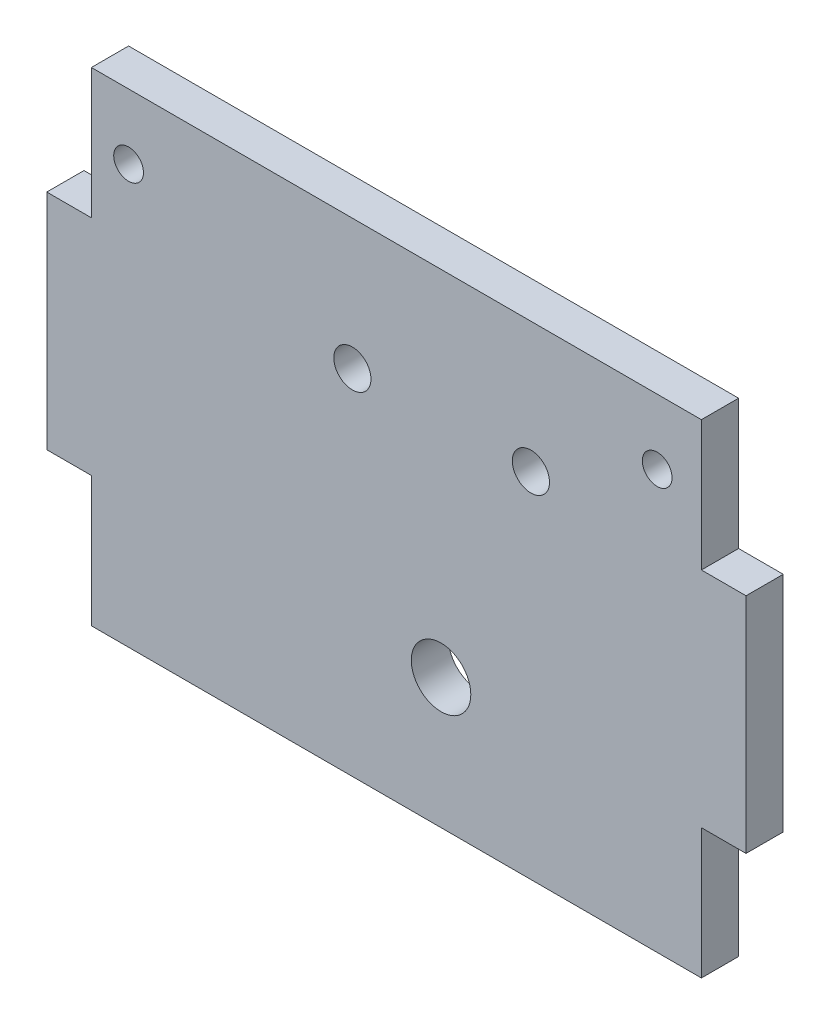
ISO-10303-21;
HEADER;
FILE_DESCRIPTION(('STEP AP214'),'2;1');
FILE_NAME('part.step','',(''),(''),'','','');
FILE_SCHEMA(('AUTOMOTIVE_DESIGN { 1 0 10303 214 1 1 1 1 }'));
ENDSEC;
DATA;
#1=APPLICATION_CONTEXT('core data for automotive mechanical design processes');
#2=APPLICATION_PROTOCOL_DEFINITION('international standard','automotive_design',2000,#1);
#3=PRODUCT_CONTEXT('',#1,'mechanical');
#4=PRODUCT('Part','Part','',(#3));
#5=PRODUCT_RELATED_PRODUCT_CATEGORY('part','',(#4));
#6=PRODUCT_DEFINITION_FORMATION('','',#4);
#7=PRODUCT_DEFINITION_CONTEXT('part definition',#1,'design');
#8=PRODUCT_DEFINITION('design','',#6,#7);
#9=PRODUCT_DEFINITION_SHAPE('','',#8);
#10=(LENGTH_UNIT() NAMED_UNIT(*) SI_UNIT(.MILLI.,.METRE.));
#11=(NAMED_UNIT(*) PLANE_ANGLE_UNIT() SI_UNIT($,.RADIAN.));
#12=(NAMED_UNIT(*) SI_UNIT($,.STERADIAN.) SOLID_ANGLE_UNIT());
#13=UNCERTAINTY_MEASURE_WITH_UNIT(LENGTH_MEASURE(1.E-05),#10,'distance_accuracy_value','');
#14=(GEOMETRIC_REPRESENTATION_CONTEXT(3) GLOBAL_UNCERTAINTY_ASSIGNED_CONTEXT((#13)) GLOBAL_UNIT_ASSIGNED_CONTEXT((#10,
#11,#12)) REPRESENTATION_CONTEXT('',''));
#15=CARTESIAN_POINT('',(0.,0.,0.));
#16=DIRECTION('',(0.,0.,1.));
#17=DIRECTION('',(1.,0.,0.));
#18=AXIS2_PLACEMENT_3D('',#15,#16,#17);
#19=CARTESIAN_POINT('',(0.,17.5,-30.5941170815567));
#20=DIRECTION('',(0.,-1.,0.));
#21=DIRECTION('',(0.,0.,-1.));
#22=AXIS2_PLACEMENT_3D('',#19,#20,#21);
#23=PLANE('',#22);
#24=DIRECTION('',(1.,0.,0.));
#25=VECTOR('',#24,1.);
#26=CARTESIAN_POINT('',(0.,17.5,5.));
#27=LINE('',#26,#25);
#28=CARTESIAN_POINT('',(60.,17.5,5.));
#29=VERTEX_POINT('',#28);
#30=CARTESIAN_POINT('',(66.,17.5,5.));
#31=VERTEX_POINT('',#30);
#32=EDGE_CURVE('E185',#29,#31,#27,.T.);
#33=ORIENTED_EDGE('',*,*,#32,.F.);
#34=DIRECTION('',(0.,0.,1.));
#35=VECTOR('',#34,1.);
#36=CARTESIAN_POINT('',(60.,17.5,5.));
#37=LINE('',#36,#35);
#38=CARTESIAN_POINT('',(60.,17.5,0.));
#39=VERTEX_POINT('',#38);
#40=EDGE_CURVE('E142',#39,#29,#37,.T.);
#41=ORIENTED_EDGE('',*,*,#40,.F.);
#42=DIRECTION('',(1.,0.,0.));
#43=VECTOR('',#42,1.);
#44=CARTESIAN_POINT('',(0.,17.5,0.));
#45=LINE('',#44,#43);
#46=CARTESIAN_POINT('',(66.,17.5,0.));
#47=VERTEX_POINT('',#46);
#48=EDGE_CURVE('E187',#39,#47,#45,.T.);
#49=ORIENTED_EDGE('',*,*,#48,.T.);
#50=DIRECTION('',(0.,0.,-1.));
#51=VECTOR('',#50,1.);
#52=CARTESIAN_POINT('',(66.,17.5,0.));
#53=LINE('',#52,#51);
#54=EDGE_CURVE('E161',#31,#47,#53,.T.);
#55=ORIENTED_EDGE('',*,*,#54,.F.);
#56=EDGE_LOOP('',(#33,#41,#49,#55));
#57=FACE_BOUND('',#56,.T.);
#58=ADVANCED_FACE('F33',(#57),#23,.T.);
#59=CARTESIAN_POINT('',(-22.,65.,70.0076918525801));
#60=DIRECTION('',(-1.,0.,0.));
#61=DIRECTION('',(0.,0.,1.));
#62=AXIS2_PLACEMENT_3D('',#59,#60,#61);
#63=PLANE('',#62);
#64=DIRECTION('',(0.,1.,0.));
#65=VECTOR('',#64,1.);
#66=CARTESIAN_POINT('',(-22.,65.,0.));
#67=LINE('',#66,#65);
#68=CARTESIAN_POINT('',(-22.,47.5,0.));
#69=VERTEX_POINT('',#68);
#70=CARTESIAN_POINT('',(-22.,65.,0.));
#71=VERTEX_POINT('',#70);
#72=EDGE_CURVE('E58',#69,#71,#67,.T.);
#73=ORIENTED_EDGE('',*,*,#72,.F.);
#74=DIRECTION('',(0.,0.,1.));
#75=VECTOR('',#74,1.);
#76=CARTESIAN_POINT('',(-22.,47.5,-30.5941170815567));
#77=LINE('',#76,#75);
#78=CARTESIAN_POINT('',(-22.,47.5,5.));
#79=VERTEX_POINT('',#78);
#80=EDGE_CURVE('E202',#69,#79,#77,.T.);
#81=ORIENTED_EDGE('',*,*,#80,.T.);
#82=DIRECTION('',(0.,-1.,0.));
#83=VECTOR('',#82,1.);
#84=CARTESIAN_POINT('',(-22.,65.,5.));
#85=LINE('',#84,#83);
#86=CARTESIAN_POINT('',(-22.,65.,5.));
#87=VERTEX_POINT('',#86);
#88=EDGE_CURVE('E216',#87,#79,#85,.T.);
#89=ORIENTED_EDGE('',*,*,#88,.F.);
#90=DIRECTION('',(0.,0.,-1.));
#91=VECTOR('',#90,1.);
#92=CARTESIAN_POINT('',(-22.,65.,70.0076918525801));
#93=LINE('',#92,#91);
#94=EDGE_CURVE('E224',#87,#71,#93,.T.);
#95=ORIENTED_EDGE('',*,*,#94,.T.);
#96=EDGE_LOOP('',(#73,#81,#89,#95));
#97=FACE_BOUND('',#96,.T.);
#98=ADVANCED_FACE('F255',(#97),#63,.T.);
#99=CARTESIAN_POINT('',(0.,0.,5.));
#100=DIRECTION('',(0.,0.,-1.));
#101=DIRECTION('',(-1.,0.,0.));
#102=AXIS2_PLACEMENT_3D('',#99,#100,#101);
#103=PLANE('',#102);
#104=CARTESIAN_POINT('',(13.0817527217629,47.5,5.));
#105=DIRECTION('',(0.,0.,1.));
#106=DIRECTION('',(1.,0.,0.));
#107=AXIS2_PLACEMENT_3D('',#104,#105,#106);
#108=CIRCLE('',#107,2.5);
#109=CARTESIAN_POINT('',(15.5817527217629,47.5,5.));
#110=VERTEX_POINT('',#109);
#111=EDGE_CURVE('E238',#110,#110,#108,.T.);
#112=ORIENTED_EDGE('',*,*,#111,.F.);
#113=EDGE_LOOP('',(#112));
#114=FACE_BOUND('',#113,.T.);
#115=CARTESIAN_POINT('',(37.0817527217629,47.5,5.));
#116=DIRECTION('',(0.,0.,1.));
#117=DIRECTION('',(1.,0.,0.));
#118=AXIS2_PLACEMENT_3D('',#115,#116,#117);
#119=CIRCLE('',#118,2.5);
#120=CARTESIAN_POINT('',(39.5817527217629,47.5,5.));
#121=VERTEX_POINT('',#120);
#122=EDGE_CURVE('E243',#121,#121,#119,.T.);
#123=ORIENTED_EDGE('',*,*,#122,.F.);
#124=EDGE_LOOP('',(#123));
#125=FACE_BOUND('',#124,.T.);
#126=CARTESIAN_POINT('',(54.0556394164773,56.25,5.));
#127=DIRECTION('',(0.,0.,1.));
#128=DIRECTION('',(1.,0.,0.));
#129=AXIS2_PLACEMENT_3D('',#126,#127,#128);
#130=CIRCLE('',#129,2.);
#131=CARTESIAN_POINT('',(56.0556394164773,56.25,5.));
#132=VERTEX_POINT('',#131);
#133=EDGE_CURVE('E146',#132,#132,#130,.T.);
#134=ORIENTED_EDGE('',*,*,#133,.F.);
#135=EDGE_LOOP('',(#134));
#136=FACE_BOUND('',#135,.T.);
#137=DIRECTION('',(0.,-1.,0.));
#138=VECTOR('',#137,1.);
#139=CARTESIAN_POINT('',(60.,65.,5.));
#140=LINE('',#139,#138);
#141=CARTESIAN_POINT('',(60.,65.,5.));
#142=VERTEX_POINT('',#141);
#143=CARTESIAN_POINT('',(60.,47.5,5.));
#144=VERTEX_POINT('',#143);
#145=EDGE_CURVE('E169',#142,#144,#140,.T.);
#146=ORIENTED_EDGE('',*,*,#145,.F.);
#147=DIRECTION('',(-1.,0.,0.));
#148=VECTOR('',#147,1.);
#149=CARTESIAN_POINT('',(0.,65.,5.));
#150=LINE('',#149,#148);
#151=EDGE_CURVE('E11',#142,#87,#150,.T.);
#152=ORIENTED_EDGE('',*,*,#151,.T.);
#153=ORIENTED_EDGE('',*,*,#88,.T.);
#154=DIRECTION('',(1.,0.,0.));
#155=VECTOR('',#154,1.);
#156=CARTESIAN_POINT('',(0.,47.5,5.));
#157=LINE('',#156,#155);
#158=CARTESIAN_POINT('',(-28.,47.5,5.));
#159=VERTEX_POINT('',#158);
#160=EDGE_CURVE('E199',#159,#79,#157,.T.);
#161=ORIENTED_EDGE('',*,*,#160,.F.);
#162=DIRECTION('',(0.,1.,0.));
#163=VECTOR('',#162,1.);
#164=CARTESIAN_POINT('',(-28.,0.,5.));
#165=LINE('',#164,#163);
#166=CARTESIAN_POINT('',(-28.,17.5,5.));
#167=VERTEX_POINT('',#166);
#168=EDGE_CURVE('E195',#167,#159,#165,.T.);
#169=ORIENTED_EDGE('',*,*,#168,.F.);
#170=DIRECTION('',(-1.,0.,0.));
#171=VECTOR('',#170,1.);
#172=CARTESIAN_POINT('',(0.,17.5,5.));
#173=LINE('',#172,#171);
#174=CARTESIAN_POINT('',(-22.,17.5,5.));
#175=VERTEX_POINT('',#174);
#176=EDGE_CURVE('E190',#175,#167,#173,.T.);
#177=ORIENTED_EDGE('',*,*,#176,.F.);
#178=CARTESIAN_POINT('',(-22.,0.,5.));
#179=VERTEX_POINT('',#178);
#180=EDGE_CURVE('E132',#175,#179,#85,.T.);
#181=ORIENTED_EDGE('',*,*,#180,.T.);
#182=DIRECTION('',(1.,0.,0.));
#183=VECTOR('',#182,1.);
#184=CARTESIAN_POINT('',(0.,0.,5.));
#185=LINE('',#184,#183);
#186=CARTESIAN_POINT('',(60.,0.,5.));
#187=VERTEX_POINT('',#186);
#188=EDGE_CURVE('E42',#179,#187,#185,.T.);
#189=ORIENTED_EDGE('',*,*,#188,.T.);
#190=DIRECTION('',(0.,-1.,0.));
#191=VECTOR('',#190,1.);
#192=CARTESIAN_POINT('',(60.,0.,5.));
#193=LINE('',#192,#191);
#194=EDGE_CURVE('E129',#29,#187,#193,.T.);
#195=ORIENTED_EDGE('',*,*,#194,.F.);
#196=ORIENTED_EDGE('',*,*,#32,.T.);
#197=DIRECTION('',(0.,-1.,0.));
#198=VECTOR('',#197,1.);
#199=CARTESIAN_POINT('',(66.,47.5,5.));
#200=LINE('',#199,#198);
#201=CARTESIAN_POINT('',(66.,47.5,5.));
#202=VERTEX_POINT('',#201);
#203=EDGE_CURVE('E158',#202,#31,#200,.T.);
#204=ORIENTED_EDGE('',*,*,#203,.F.);
#205=DIRECTION('',(-1.,0.,0.));
#206=VECTOR('',#205,1.);
#207=CARTESIAN_POINT('',(66.,47.5,5.));
#208=LINE('',#207,#206);
#209=EDGE_CURVE('E164',#202,#144,#208,.T.);
#210=ORIENTED_EDGE('',*,*,#209,.T.);
#211=EDGE_LOOP('',(#146,#152,#153,#161,#169,#177,#181,#189,#195,#196,#204,#210));
#212=FACE_BOUND('',#211,.T.);
#213=CARTESIAN_POINT('',(-17.,56.25,5.));
#214=DIRECTION('',(0.,0.,1.));
#215=DIRECTION('',(1.,0.,0.));
#216=AXIS2_PLACEMENT_3D('',#213,#214,#215);
#217=CIRCLE('',#216,2.);
#218=CARTESIAN_POINT('',(-15.,56.25,5.));
#219=VERTEX_POINT('',#218);
#220=EDGE_CURVE('E181',#219,#219,#217,.T.);
#221=ORIENTED_EDGE('',*,*,#220,.F.);
#222=EDGE_LOOP('',(#221));
#223=FACE_BOUND('',#222,.T.);
#224=CARTESIAN_POINT('',(25.,17.5,5.));
#225=DIRECTION('',(0.,0.,1.));
#226=DIRECTION('',(1.,0.,0.));
#227=AXIS2_PLACEMENT_3D('',#224,#225,#226);
#228=CIRCLE('',#227,4.);
#229=CARTESIAN_POINT('',(29.,17.5,5.));
#230=VERTEX_POINT('',#229);
#231=EDGE_CURVE('E227',#230,#230,#228,.T.);
#232=ORIENTED_EDGE('',*,*,#231,.F.);
#233=EDGE_LOOP('',(#232));
#234=FACE_BOUND('',#233,.T.);
#235=ADVANCED_FACE('F126',(#114,#125,#136,#212,#223,#234),#103,.F.);
#236=CARTESIAN_POINT('',(0.,0.,0.));
#237=DIRECTION('',(0.,0.,-1.));
#238=DIRECTION('',(-1.,0.,0.));
#239=AXIS2_PLACEMENT_3D('',#236,#237,#238);
#240=PLANE('',#239);
#241=CARTESIAN_POINT('',(13.0817527217629,47.5,0.));
#242=DIRECTION('',(0.,0.,-1.));
#243=DIRECTION('',(-1.,0.,0.));
#244=AXIS2_PLACEMENT_3D('',#241,#242,#243);
#245=CIRCLE('',#244,2.5);
#246=CARTESIAN_POINT('',(10.5817527217629,47.5,0.));
#247=VERTEX_POINT('',#246);
#248=EDGE_CURVE('E37',#247,#247,#245,.T.);
#249=ORIENTED_EDGE('',*,*,#248,.F.);
#250=EDGE_LOOP('',(#249));
#251=FACE_BOUND('',#250,.T.);
#252=CARTESIAN_POINT('',(37.0817527217629,47.5,0.));
#253=DIRECTION('',(0.,0.,-1.));
#254=DIRECTION('',(-1.,0.,0.));
#255=AXIS2_PLACEMENT_3D('',#252,#253,#254);
#256=CIRCLE('',#255,2.5);
#257=CARTESIAN_POINT('',(34.5817527217629,47.5,0.));
#258=VERTEX_POINT('',#257);
#259=EDGE_CURVE('E236',#258,#258,#256,.T.);
#260=ORIENTED_EDGE('',*,*,#259,.F.);
#261=EDGE_LOOP('',(#260));
#262=FACE_BOUND('',#261,.T.);
#263=CARTESIAN_POINT('',(54.0556394164773,56.25,0.));
#264=DIRECTION('',(0.,0.,-1.));
#265=DIRECTION('',(-1.,0.,0.));
#266=AXIS2_PLACEMENT_3D('',#263,#264,#265);
#267=CIRCLE('',#266,2.);
#268=CARTESIAN_POINT('',(52.0556394164773,56.25,0.));
#269=VERTEX_POINT('',#268);
#270=EDGE_CURVE('E143',#269,#269,#267,.T.);
#271=ORIENTED_EDGE('',*,*,#270,.F.);
#272=EDGE_LOOP('',(#271));
#273=FACE_BOUND('',#272,.T.);
#274=DIRECTION('',(-1.,0.,0.));
#275=VECTOR('',#274,1.);
#276=CARTESIAN_POINT('',(0.,65.,0.));
#277=LINE('',#276,#275);
#278=CARTESIAN_POINT('',(60.,65.,0.));
#279=VERTEX_POINT('',#278);
#280=EDGE_CURVE('E136',#279,#71,#277,.T.);
#281=ORIENTED_EDGE('',*,*,#280,.F.);
#282=DIRECTION('',(0.,1.,0.));
#283=VECTOR('',#282,1.);
#284=CARTESIAN_POINT('',(60.,65.,0.));
#285=LINE('',#284,#283);
#286=CARTESIAN_POINT('',(60.,47.5,0.));
#287=VERTEX_POINT('',#286);
#288=EDGE_CURVE('E175',#287,#279,#285,.T.);
#289=ORIENTED_EDGE('',*,*,#288,.F.);
#290=DIRECTION('',(-1.,0.,0.));
#291=VECTOR('',#290,1.);
#292=CARTESIAN_POINT('',(66.,47.5,0.));
#293=LINE('',#292,#291);
#294=CARTESIAN_POINT('',(66.,47.5,0.));
#295=VERTEX_POINT('',#294);
#296=EDGE_CURVE('E167',#295,#287,#293,.T.);
#297=ORIENTED_EDGE('',*,*,#296,.F.);
#298=DIRECTION('',(0.,1.,0.));
#299=VECTOR('',#298,1.);
#300=CARTESIAN_POINT('',(66.,47.5,0.));
#301=LINE('',#300,#299);
#302=EDGE_CURVE('E153',#47,#295,#301,.T.);
#303=ORIENTED_EDGE('',*,*,#302,.F.);
#304=ORIENTED_EDGE('',*,*,#48,.F.);
#305=DIRECTION('',(0.,1.,0.));
#306=VECTOR('',#305,1.);
#307=CARTESIAN_POINT('',(60.,0.,0.));
#308=LINE('',#307,#306);
#309=CARTESIAN_POINT('',(60.,0.,0.));
#310=VERTEX_POINT('',#309);
#311=EDGE_CURVE('E50',#310,#39,#308,.T.);
#312=ORIENTED_EDGE('',*,*,#311,.F.);
#313=DIRECTION('',(1.,0.,0.));
#314=VECTOR('',#313,1.);
#315=CARTESIAN_POINT('',(0.,0.,0.));
#316=LINE('',#315,#314);
#317=CARTESIAN_POINT('',(-22.,0.,0.));
#318=VERTEX_POINT('',#317);
#319=EDGE_CURVE('E139',#318,#310,#316,.T.);
#320=ORIENTED_EDGE('',*,*,#319,.F.);
#321=CARTESIAN_POINT('',(-22.,17.5,0.));
#322=VERTEX_POINT('',#321);
#323=EDGE_CURVE('E220',#318,#322,#67,.T.);
#324=ORIENTED_EDGE('',*,*,#323,.T.);
#325=DIRECTION('',(-1.,0.,0.));
#326=VECTOR('',#325,1.);
#327=CARTESIAN_POINT('',(0.,17.5,0.));
#328=LINE('',#327,#326);
#329=CARTESIAN_POINT('',(-28.,17.5,0.));
#330=VERTEX_POINT('',#329);
#331=EDGE_CURVE('E203',#322,#330,#328,.T.);
#332=ORIENTED_EDGE('',*,*,#331,.T.);
#333=DIRECTION('',(0.,1.,0.));
#334=VECTOR('',#333,1.);
#335=CARTESIAN_POINT('',(-28.,0.,0.));
#336=LINE('',#335,#334);
#337=CARTESIAN_POINT('',(-28.,47.5,0.));
#338=VERTEX_POINT('',#337);
#339=EDGE_CURVE('E198',#330,#338,#336,.T.);
#340=ORIENTED_EDGE('',*,*,#339,.T.);
#341=DIRECTION('',(1.,0.,0.));
#342=VECTOR('',#341,1.);
#343=CARTESIAN_POINT('',(0.,47.5,0.));
#344=LINE('',#343,#342);
#345=EDGE_CURVE('E206',#338,#69,#344,.T.);
#346=ORIENTED_EDGE('',*,*,#345,.T.);
#347=ORIENTED_EDGE('',*,*,#72,.T.);
#348=EDGE_LOOP('',(#281,#289,#297,#303,#304,#312,#320,#324,#332,#340,#346,#347));
#349=FACE_BOUND('',#348,.T.);
#350=CARTESIAN_POINT('',(-17.,56.25,0.));
#351=DIRECTION('',(0.,0.,-1.));
#352=DIRECTION('',(-1.,0.,0.));
#353=AXIS2_PLACEMENT_3D('',#350,#351,#352);
#354=CIRCLE('',#353,2.);
#355=CARTESIAN_POINT('',(-19.,56.25,0.));
#356=VERTEX_POINT('',#355);
#357=EDGE_CURVE('E184',#356,#356,#354,.T.);
#358=ORIENTED_EDGE('',*,*,#357,.F.);
#359=EDGE_LOOP('',(#358));
#360=FACE_BOUND('',#359,.T.);
#361=CARTESIAN_POINT('',(25.,17.5,0.));
#362=DIRECTION('',(0.,0.,1.));
#363=DIRECTION('',(1.,0.,0.));
#364=AXIS2_PLACEMENT_3D('',#361,#362,#363);
#365=CIRCLE('',#364,4.);
#366=CARTESIAN_POINT('',(29.,17.5,0.));
#367=VERTEX_POINT('',#366);
#368=EDGE_CURVE('E219',#367,#367,#365,.T.);
#369=ORIENTED_EDGE('',*,*,#368,.T.);
#370=EDGE_LOOP('',(#369));
#371=FACE_BOUND('',#370,.T.);
#372=ADVANCED_FACE('F254',(#251,#262,#273,#349,#360,#371),#240,.T.);
#373=CARTESIAN_POINT('',(0.,0.,5.));
#374=DIRECTION('',(0.,1.,0.));
#375=DIRECTION('',(0.,0.,1.));
#376=AXIS2_PLACEMENT_3D('',#373,#374,#375);
#377=PLANE('',#376);
#378=ORIENTED_EDGE('',*,*,#319,.T.);
#379=DIRECTION('',(0.,0.,-1.));
#380=VECTOR('',#379,1.);
#381=CARTESIAN_POINT('',(60.,0.,5.));
#382=LINE('',#381,#380);
#383=EDGE_CURVE('E138',#187,#310,#382,.T.);
#384=ORIENTED_EDGE('',*,*,#383,.F.);
#385=ORIENTED_EDGE('',*,*,#188,.F.);
#386=DIRECTION('',(0.,0.,-1.));
#387=VECTOR('',#386,1.);
#388=CARTESIAN_POINT('',(-22.,0.,70.0076918525801));
#389=LINE('',#388,#387);
#390=EDGE_CURVE('E223',#179,#318,#389,.T.);
#391=ORIENTED_EDGE('',*,*,#390,.T.);
#392=EDGE_LOOP('',(#378,#384,#385,#391));
#393=FACE_BOUND('',#392,.T.);
#394=ADVANCED_FACE('F35',(#393),#377,.F.);
#395=CARTESIAN_POINT('',(0.,65.,5.));
#396=DIRECTION('',(0.,-1.,0.));
#397=DIRECTION('',(0.,0.,-1.));
#398=AXIS2_PLACEMENT_3D('',#395,#396,#397);
#399=PLANE('',#398);
#400=ORIENTED_EDGE('',*,*,#280,.T.);
#401=ORIENTED_EDGE('',*,*,#94,.F.);
#402=ORIENTED_EDGE('',*,*,#151,.F.);
#403=DIRECTION('',(0.,0.,1.));
#404=VECTOR('',#403,1.);
#405=CARTESIAN_POINT('',(60.,65.,5.));
#406=LINE('',#405,#404);
#407=EDGE_CURVE('E178',#279,#142,#406,.T.);
#408=ORIENTED_EDGE('',*,*,#407,.F.);
#409=EDGE_LOOP('',(#400,#401,#402,#408));
#410=FACE_BOUND('',#409,.T.);
#411=ADVANCED_FACE('F303',(#410),#399,.F.);
#412=CARTESIAN_POINT('',(25.,17.5,5.));
#413=DIRECTION('',(0.,0.,-1.));
#414=DIRECTION('',(-1.,0.,0.));
#415=AXIS2_PLACEMENT_3D('',#412,#413,#414);
#416=CYLINDRICAL_SURFACE('',#415,4.);
#417=ORIENTED_EDGE('',*,*,#231,.T.);
#418=EDGE_LOOP('',(#417));
#419=FACE_BOUND('',#418,.T.);
#420=ORIENTED_EDGE('',*,*,#368,.F.);
#421=EDGE_LOOP('',(#420));
#422=FACE_BOUND('',#421,.T.);
#423=ADVANCED_FACE('F300',(#419,#422),#416,.F.);
#424=DIRECTION('',(0.,0.,1.));
#425=VECTOR('',#424,1.);
#426=CARTESIAN_POINT('',(-22.,17.5,-30.5941170815567));
#427=LINE('',#426,#425);
#428=EDGE_CURVE('E194',#322,#175,#427,.T.);
#429=ORIENTED_EDGE('',*,*,#428,.F.);
#430=ORIENTED_EDGE('',*,*,#323,.F.);
#431=ORIENTED_EDGE('',*,*,#390,.F.);
#432=ORIENTED_EDGE('',*,*,#180,.F.);
#433=EDGE_LOOP('',(#429,#430,#431,#432));
#434=FACE_BOUND('',#433,.T.);
#435=ADVANCED_FACE('F282',(#434),#63,.T.);
#436=CARTESIAN_POINT('',(0.,47.5,-30.5941170815567));
#437=DIRECTION('',(0.,-1.,0.));
#438=DIRECTION('',(0.,0.,-1.));
#439=AXIS2_PLACEMENT_3D('',#436,#437,#438);
#440=PLANE('',#439);
#441=ORIENTED_EDGE('',*,*,#345,.F.);
#442=DIRECTION('',(0.,0.,1.));
#443=VECTOR('',#442,1.);
#444=CARTESIAN_POINT('',(-28.,47.5,-30.5941170815567));
#445=LINE('',#444,#443);
#446=EDGE_CURVE('E189',#338,#159,#445,.T.);
#447=ORIENTED_EDGE('',*,*,#446,.T.);
#448=ORIENTED_EDGE('',*,*,#160,.T.);
#449=ORIENTED_EDGE('',*,*,#80,.F.);
#450=EDGE_LOOP('',(#441,#447,#448,#449));
#451=FACE_BOUND('',#450,.T.);
#452=ADVANCED_FACE('F294',(#451),#440,.F.);
#453=CARTESIAN_POINT('',(0.,17.5,-30.5941170815567));
#454=DIRECTION('',(0.,1.,0.));
#455=DIRECTION('',(0.,0.,1.));
#456=AXIS2_PLACEMENT_3D('',#453,#454,#455);
#457=PLANE('',#456);
#458=ORIENTED_EDGE('',*,*,#331,.F.);
#459=ORIENTED_EDGE('',*,*,#428,.T.);
#460=ORIENTED_EDGE('',*,*,#176,.T.);
#461=DIRECTION('',(0.,0.,1.));
#462=VECTOR('',#461,1.);
#463=CARTESIAN_POINT('',(-28.,17.5,-30.5941170815567));
#464=LINE('',#463,#462);
#465=EDGE_CURVE('E193',#330,#167,#464,.T.);
#466=ORIENTED_EDGE('',*,*,#465,.F.);
#467=EDGE_LOOP('',(#458,#459,#460,#466));
#468=FACE_BOUND('',#467,.T.);
#469=ADVANCED_FACE('F290',(#468),#457,.F.);
#470=CARTESIAN_POINT('',(-28.,0.,-30.5941170815567));
#471=DIRECTION('',(1.,0.,0.));
#472=DIRECTION('',(0.,0.,-1.));
#473=AXIS2_PLACEMENT_3D('',#470,#471,#472);
#474=PLANE('',#473);
#475=ORIENTED_EDGE('',*,*,#339,.F.);
#476=ORIENTED_EDGE('',*,*,#465,.T.);
#477=ORIENTED_EDGE('',*,*,#168,.T.);
#478=ORIENTED_EDGE('',*,*,#446,.F.);
#479=EDGE_LOOP('',(#475,#476,#477,#478));
#480=FACE_BOUND('',#479,.T.);
#481=ADVANCED_FACE('F287',(#480),#474,.F.);
#482=CARTESIAN_POINT('',(-17.,56.25,-5.));
#483=DIRECTION('',(0.,0.,1.));
#484=DIRECTION('',(1.,0.,0.));
#485=AXIS2_PLACEMENT_3D('',#482,#483,#484);
#486=CYLINDRICAL_SURFACE('',#485,2.);
#487=ORIENTED_EDGE('',*,*,#357,.T.);
#488=EDGE_LOOP('',(#487));
#489=FACE_BOUND('',#488,.T.);
#490=ORIENTED_EDGE('',*,*,#220,.T.);
#491=EDGE_LOOP('',(#490));
#492=FACE_BOUND('',#491,.T.);
#493=ADVANCED_FACE('F285',(#489,#492),#486,.F.);
#494=CARTESIAN_POINT('',(60.,0.,0.));
#495=DIRECTION('',(1.,0.,0.));
#496=DIRECTION('',(0.,0.,-1.));
#497=AXIS2_PLACEMENT_3D('',#494,#495,#496);
#498=PLANE('',#497);
#499=ORIENTED_EDGE('',*,*,#145,.T.);
#500=DIRECTION('',(0.,0.,-1.));
#501=VECTOR('',#500,1.);
#502=CARTESIAN_POINT('',(60.,47.5,5.));
#503=LINE('',#502,#501);
#504=EDGE_CURVE('E172',#144,#287,#503,.T.);
#505=ORIENTED_EDGE('',*,*,#504,.T.);
#506=ORIENTED_EDGE('',*,*,#288,.T.);
#507=ORIENTED_EDGE('',*,*,#407,.T.);
#508=EDGE_LOOP('',(#499,#505,#506,#507));
#509=FACE_BOUND('',#508,.T.);
#510=ADVANCED_FACE('F334',(#509),#498,.T.);
#511=CARTESIAN_POINT('',(66.,47.5,0.));
#512=DIRECTION('',(0.,-1.,0.));
#513=DIRECTION('',(0.,0.,-1.));
#514=AXIS2_PLACEMENT_3D('',#511,#512,#513);
#515=PLANE('',#514);
#516=ORIENTED_EDGE('',*,*,#504,.F.);
#517=ORIENTED_EDGE('',*,*,#209,.F.);
#518=DIRECTION('',(0.,0.,1.));
#519=VECTOR('',#518,1.);
#520=CARTESIAN_POINT('',(66.,47.5,0.));
#521=LINE('',#520,#519);
#522=EDGE_CURVE('E156',#295,#202,#521,.T.);
#523=ORIENTED_EDGE('',*,*,#522,.F.);
#524=ORIENTED_EDGE('',*,*,#296,.T.);
#525=EDGE_LOOP('',(#516,#517,#523,#524));
#526=FACE_BOUND('',#525,.T.);
#527=ADVANCED_FACE('F335',(#526),#515,.F.);
#528=CARTESIAN_POINT('',(66.,0.,0.));
#529=DIRECTION('',(-1.,0.,0.));
#530=DIRECTION('',(0.,0.,1.));
#531=AXIS2_PLACEMENT_3D('',#528,#529,#530);
#532=PLANE('',#531);
#533=ORIENTED_EDGE('',*,*,#302,.T.);
#534=ORIENTED_EDGE('',*,*,#522,.T.);
#535=ORIENTED_EDGE('',*,*,#203,.T.);
#536=ORIENTED_EDGE('',*,*,#54,.T.);
#537=EDGE_LOOP('',(#533,#534,#535,#536));
#538=FACE_BOUND('',#537,.T.);
#539=ADVANCED_FACE('F271',(#538),#532,.F.);
#540=CARTESIAN_POINT('',(60.,0.,0.));
#541=DIRECTION('',(-1.,0.,0.));
#542=DIRECTION('',(0.,0.,1.));
#543=AXIS2_PLACEMENT_3D('',#540,#541,#542);
#544=PLANE('',#543);
#545=ORIENTED_EDGE('',*,*,#194,.T.);
#546=ORIENTED_EDGE('',*,*,#383,.T.);
#547=ORIENTED_EDGE('',*,*,#311,.T.);
#548=ORIENTED_EDGE('',*,*,#40,.T.);
#549=EDGE_LOOP('',(#545,#546,#547,#548));
#550=FACE_BOUND('',#549,.T.);
#551=ADVANCED_FACE('F141',(#550),#544,.F.);
#552=CARTESIAN_POINT('',(54.0556394164773,56.25,-5.));
#553=DIRECTION('',(0.,0.,1.));
#554=DIRECTION('',(1.,0.,0.));
#555=AXIS2_PLACEMENT_3D('',#552,#553,#554);
#556=CYLINDRICAL_SURFACE('',#555,2.);
#557=ORIENTED_EDGE('',*,*,#270,.T.);
#558=EDGE_LOOP('',(#557));
#559=FACE_BOUND('',#558,.T.);
#560=ORIENTED_EDGE('',*,*,#133,.T.);
#561=EDGE_LOOP('',(#560));
#562=FACE_BOUND('',#561,.T.);
#563=ADVANCED_FACE('F261',(#559,#562),#556,.F.);
#564=CARTESIAN_POINT('',(37.0817527217629,47.5,-5.));
#565=DIRECTION('',(0.,0.,1.));
#566=DIRECTION('',(1.,0.,0.));
#567=AXIS2_PLACEMENT_3D('',#564,#565,#566);
#568=CYLINDRICAL_SURFACE('',#567,2.5);
#569=ORIENTED_EDGE('',*,*,#259,.T.);
#570=EDGE_LOOP('',(#569));
#571=FACE_BOUND('',#570,.T.);
#572=ORIENTED_EDGE('',*,*,#122,.T.);
#573=EDGE_LOOP('',(#572));
#574=FACE_BOUND('',#573,.T.);
#575=ADVANCED_FACE('F250',(#571,#574),#568,.F.);
#576=CARTESIAN_POINT('',(13.0817527217629,47.5,-5.));
#577=DIRECTION('',(0.,0.,1.));
#578=DIRECTION('',(1.,0.,0.));
#579=AXIS2_PLACEMENT_3D('',#576,#577,#578);
#580=CYLINDRICAL_SURFACE('',#579,2.5);
#581=ORIENTED_EDGE('',*,*,#248,.T.);
#582=EDGE_LOOP('',(#581));
#583=FACE_BOUND('',#582,.T.);
#584=ORIENTED_EDGE('',*,*,#111,.T.);
#585=EDGE_LOOP('',(#584));
#586=FACE_BOUND('',#585,.T.);
#587=ADVANCED_FACE('F269',(#583,#586),#580,.F.);
#588=CLOSED_SHELL('',(#58,#98,#235,#372,#394,#411,#423,#435,#452,#469,#481,#493,#510,#527,#539,
#551,#563,#575,#587));
#589=MANIFOLD_SOLID_BREP('B2',#588);
#590=ADVANCED_BREP_SHAPE_REPRESENTATION('',(#18,#589),#14);
#591=SHAPE_DEFINITION_REPRESENTATION(#9,#590);
ENDSEC;
END-ISO-10303-21;
